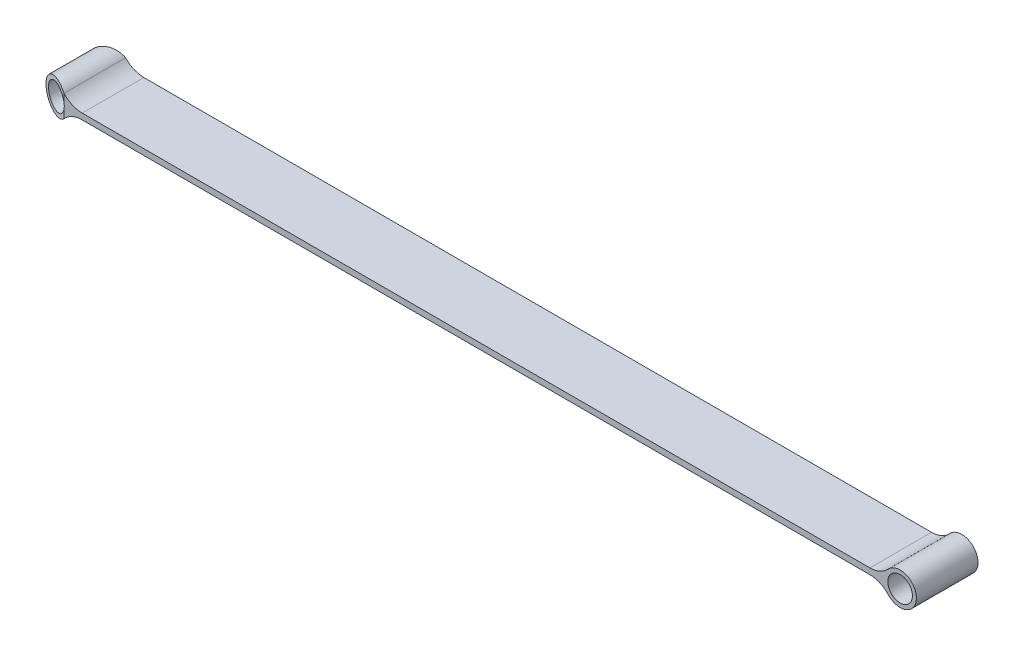
ISO-10303-21;
HEADER;
FILE_DESCRIPTION(('STEP AP214'),'2;1');
FILE_NAME('part.step','',(''),(''),'','','');
FILE_SCHEMA(('AUTOMOTIVE_DESIGN { 1 0 10303 214 1 1 1 1 }'));
ENDSEC;
DATA;
#1=APPLICATION_CONTEXT('core data for automotive mechanical design processes');
#2=APPLICATION_PROTOCOL_DEFINITION('international standard','automotive_design',2000,#1);
#3=PRODUCT_CONTEXT('',#1,'mechanical');
#4=PRODUCT('Part','Part','',(#3));
#5=PRODUCT_RELATED_PRODUCT_CATEGORY('part','',(#4));
#6=PRODUCT_DEFINITION_FORMATION('','',#4);
#7=PRODUCT_DEFINITION_CONTEXT('part definition',#1,'design');
#8=PRODUCT_DEFINITION('design','',#6,#7);
#9=PRODUCT_DEFINITION_SHAPE('','',#8);
#10=(LENGTH_UNIT() NAMED_UNIT(*) SI_UNIT(.MILLI.,.METRE.));
#11=(NAMED_UNIT(*) PLANE_ANGLE_UNIT() SI_UNIT($,.RADIAN.));
#12=(NAMED_UNIT(*) SI_UNIT($,.STERADIAN.) SOLID_ANGLE_UNIT());
#13=UNCERTAINTY_MEASURE_WITH_UNIT(LENGTH_MEASURE(1.E-05),#10,'distance_accuracy_value','');
#14=(GEOMETRIC_REPRESENTATION_CONTEXT(3) GLOBAL_UNCERTAINTY_ASSIGNED_CONTEXT((#13)) GLOBAL_UNIT_ASSIGNED_CONTEXT((#10,
#11,#12)) REPRESENTATION_CONTEXT('',''));
#15=CARTESIAN_POINT('',(0.,0.,0.));
#16=DIRECTION('',(0.,0.,1.));
#17=DIRECTION('',(1.,0.,0.));
#18=AXIS2_PLACEMENT_3D('',#15,#16,#17);
#19=CARTESIAN_POINT('',(-101.6,1.524,-7.9375));
#20=DIRECTION('',(0.,0.,1.));
#21=DIRECTION('',(1.,0.,0.));
#22=AXIS2_PLACEMENT_3D('',#19,#20,#21);
#23=PLANE('',#22);
#24=CARTESIAN_POINT('',(109.22,0.762,-7.9375));
#25=DIRECTION('',(0.,0.,-1.));
#26=DIRECTION('',(-1.,0.,0.));
#27=AXIS2_PLACEMENT_3D('',#24,#25,#26);
#28=CIRCLE('',#27,3.175);
#29=CARTESIAN_POINT('',(106.045,0.762,-7.9375));
#30=VERTEX_POINT('',#29);
#31=EDGE_CURVE('E182',#30,#30,#28,.T.);
#32=ORIENTED_EDGE('',*,*,#31,.F.);
#33=EDGE_LOOP('',(#32));
#34=FACE_BOUND('',#33,.T.);
#35=DIRECTION('',(0.,-1.,0.));
#36=VECTOR('',#35,1.);
#37=CARTESIAN_POINT('',(-106.126651501303,4.953,-7.9375));
#38=LINE('',#37,#36);
#39=CARTESIAN_POINT('',(-106.126651501303,3.58966265060242,-7.9375));
#40=VERTEX_POINT('',#39);
#41=CARTESIAN_POINT('',(-106.126651501303,1.47741600877522,-7.9375));
#42=VERTEX_POINT('',#41);
#43=EDGE_CURVE('E60',#40,#42,#38,.T.);
#44=ORIENTED_EDGE('',*,*,#43,.F.);
#45=CARTESIAN_POINT('',(-101.439759836612,7.874,-7.9375));
#46=DIRECTION('',(0.,0.,1.));
#47=DIRECTION('',(1.,0.,0.));
#48=AXIS2_PLACEMENT_3D('',#45,#46,#47);
#49=CIRCLE('',#48,6.35);
#50=CARTESIAN_POINT('',(-101.439759836612,1.524,-7.9375));
#51=VERTEX_POINT('',#50);
#52=EDGE_CURVE('E140',#51,#40,#49,.F.);
#53=ORIENTED_EDGE('',*,*,#52,.F.);
#54=DIRECTION('',(-1.,0.,0.));
#55=VECTOR('',#54,1.);
#56=CARTESIAN_POINT('',(-101.6,1.524,-7.9375));
#57=LINE('',#56,#55);
#58=CARTESIAN_POINT('',(101.439759836612,1.524,-7.9375));
#59=VERTEX_POINT('',#58);
#60=EDGE_CURVE('E44',#59,#51,#57,.T.);
#61=ORIENTED_EDGE('',*,*,#60,.F.);
#62=CARTESIAN_POINT('',(101.439759836612,7.874,-7.9375));
#63=DIRECTION('',(0.,0.,-1.));
#64=DIRECTION('',(-1.,0.,0.));
#65=AXIS2_PLACEMENT_3D('',#62,#63,#64);
#66=CIRCLE('',#65,6.35);
#67=CARTESIAN_POINT('',(106.126651501303,3.58966265060241,-7.9375));
#68=VERTEX_POINT('',#67);
#69=EDGE_CURVE('E214',#59,#68,#66,.F.);
#70=ORIENTED_EDGE('',*,*,#69,.T.);
#71=CARTESIAN_POINT('',(109.22,0.762,-7.9375));
#72=DIRECTION('',(0.,0.,-1.));
#73=DIRECTION('',(-1.,0.,0.));
#74=AXIS2_PLACEMENT_3D('',#71,#72,#73);
#75=CIRCLE('',#74,4.191);
#76=CARTESIAN_POINT('',(106.126651501303,-2.06566265060241,-7.9375));
#77=VERTEX_POINT('',#76);
#78=EDGE_CURVE('E186',#68,#77,#75,.T.);
#79=ORIENTED_EDGE('',*,*,#78,.T.);
#80=CARTESIAN_POINT('',(101.439759836612,-6.35,-7.9375));
#81=DIRECTION('',(0.,0.,-1.));
#82=DIRECTION('',(-1.,0.,0.));
#83=AXIS2_PLACEMENT_3D('',#80,#81,#82);
#84=CIRCLE('',#83,6.35);
#85=CARTESIAN_POINT('',(101.439759836612,0.,-7.9375));
#86=VERTEX_POINT('',#85);
#87=EDGE_CURVE('E199',#77,#86,#84,.F.);
#88=ORIENTED_EDGE('',*,*,#87,.T.);
#89=DIRECTION('',(-1.,0.,0.));
#90=VECTOR('',#89,1.);
#91=CARTESIAN_POINT('',(-101.6,0.,-7.9375));
#92=LINE('',#91,#90);
#93=CARTESIAN_POINT('',(-101.439759836612,0.,-7.9375));
#94=VERTEX_POINT('',#93);
#95=EDGE_CURVE('E141',#86,#94,#92,.T.);
#96=ORIENTED_EDGE('',*,*,#95,.T.);
#97=CARTESIAN_POINT('',(-101.439759836612,-6.35,-7.9375));
#98=DIRECTION('',(0.,0.,1.));
#99=DIRECTION('',(1.,0.,0.));
#100=AXIS2_PLACEMENT_3D('',#97,#98,#99);
#101=CIRCLE('',#100,6.35);
#102=CARTESIAN_POINT('',(-106.126651501303,-2.06566265060241,-7.9375));
#103=VERTEX_POINT('',#102);
#104=EDGE_CURVE('E152',#103,#94,#101,.F.);
#105=ORIENTED_EDGE('',*,*,#104,.F.);
#106=CARTESIAN_POINT('',(-106.126651501303,0.0465839912247837,-7.9375));
#107=VERTEX_POINT('',#106);
#108=EDGE_CURVE('E120',#107,#103,#38,.T.);
#109=ORIENTED_EDGE('',*,*,#108,.F.);
#110=CARTESIAN_POINT('',(-109.22,0.762,-7.9375));
#111=DIRECTION('',(0.,0.,1.));
#112=DIRECTION('',(1.,0.,0.));
#113=AXIS2_PLACEMENT_3D('',#110,#111,#112);
#114=CIRCLE('',#113,3.175);
#115=EDGE_CURVE('E148',#107,#42,#114,.T.);
#116=ORIENTED_EDGE('',*,*,#115,.T.);
#117=EDGE_LOOP('',(#44,#53,#61,#70,#79,#88,#96,#105,#109,#116));
#118=FACE_BOUND('',#117,.T.);
#119=ADVANCED_FACE('F36',(#34,#118),#23,.F.);
#120=CARTESIAN_POINT('',(-109.22,0.762,-7.9375));
#121=DIRECTION('',(0.,0.,1.));
#122=DIRECTION('',(1.,0.,0.));
#123=AXIS2_PLACEMENT_3D('',#120,#121,#122);
#124=CYLINDRICAL_SURFACE('',#123,4.191);
#125=DIRECTION('',(0.,0.,1.));
#126=VECTOR('',#125,1.);
#127=CARTESIAN_POINT('',(-106.126651501303,3.58966265060241,-7.9375));
#128=LINE('',#127,#126);
#129=CARTESIAN_POINT('',(-106.126651501303,3.58966265060242,7.9375));
#130=VERTEX_POINT('',#129);
#131=EDGE_CURVE('E127',#40,#130,#128,.T.);
#132=ORIENTED_EDGE('',*,*,#131,.F.);
#133=CARTESIAN_POINT('',(-109.22,0.762,-6.81161322226244));
#134=DIRECTION('',(-0.342020143325663,0.,-0.93969262078591));
#135=DIRECTION('',(-0.93969262078591,0.,0.342020143325663));
#136=AXIS2_PLACEMENT_3D('',#133,#134,#135);
#137=ELLIPSE('',#136,4.45996904444653,4.191);
#138=EDGE_CURVE('E209',#40,#103,#137,.F.);
#139=ORIENTED_EDGE('',*,*,#138,.T.);
#140=DIRECTION('',(0.,0.,1.));
#141=VECTOR('',#140,1.);
#142=CARTESIAN_POINT('',(-106.126651501303,-2.06566265060241,-7.9375));
#143=LINE('',#142,#141);
#144=CARTESIAN_POINT('',(-106.126651501303,-2.06566265060241,7.9375));
#145=VERTEX_POINT('',#144);
#146=EDGE_CURVE('E130',#103,#145,#143,.T.);
#147=ORIENTED_EDGE('',*,*,#146,.T.);
#148=CARTESIAN_POINT('',(-109.22,0.762,6.81161322226244));
#149=DIRECTION('',(0.342020143325663,0.,-0.93969262078591));
#150=DIRECTION('',(0.93969262078591,0.,0.342020143325663));
#151=AXIS2_PLACEMENT_3D('',#148,#149,#150);
#152=ELLIPSE('',#151,4.45996904444653,4.191);
#153=EDGE_CURVE('E114',#130,#145,#152,.F.);
#154=ORIENTED_EDGE('',*,*,#153,.F.);
#155=EDGE_LOOP('',(#132,#139,#147,#154));
#156=FACE_BOUND('',#155,.T.);
#157=ADVANCED_FACE('F126',(#156),#124,.T.);
#158=CARTESIAN_POINT('',(-109.22,0.762,-7.9375));
#159=DIRECTION('',(0.,0.,1.));
#160=DIRECTION('',(1.,0.,0.));
#161=AXIS2_PLACEMENT_3D('',#158,#159,#160);
#162=CYLINDRICAL_SURFACE('',#161,3.175);
#163=CARTESIAN_POINT('',(-109.22,0.762,7.9375));
#164=DIRECTION('',(0.,0.,1.));
#165=DIRECTION('',(1.,0.,0.));
#166=AXIS2_PLACEMENT_3D('',#163,#164,#165);
#167=CIRCLE('',#166,3.175);
#168=CARTESIAN_POINT('',(-106.126651501303,0.0465839912247604,7.9375));
#169=VERTEX_POINT('',#168);
#170=CARTESIAN_POINT('',(-106.126651501303,1.47741600877522,7.9375));
#171=VERTEX_POINT('',#170);
#172=EDGE_CURVE('E154',#169,#171,#167,.T.);
#173=ORIENTED_EDGE('',*,*,#172,.T.);
#174=CARTESIAN_POINT('',(-109.22,0.762,6.81161322226244));
#175=DIRECTION('',(0.342020143325663,0.,-0.93969262078591));
#176=DIRECTION('',(0.93969262078591,0.,0.342020143325663));
#177=AXIS2_PLACEMENT_3D('',#174,#175,#176);
#178=ELLIPSE('',#177,3.37876442761101,3.175);
#179=EDGE_CURVE('E115',#171,#169,#178,.F.);
#180=ORIENTED_EDGE('',*,*,#179,.T.);
#181=EDGE_LOOP('',(#173,#180));
#182=FACE_BOUND('',#181,.T.);
#183=CARTESIAN_POINT('',(-109.22,0.762,-6.81161322226244));
#184=DIRECTION('',(-0.342020143325663,0.,-0.93969262078591));
#185=DIRECTION('',(-0.93969262078591,0.,0.342020143325663));
#186=AXIS2_PLACEMENT_3D('',#183,#184,#185);
#187=ELLIPSE('',#186,3.37876442761101,3.175);
#188=EDGE_CURVE('E132',#42,#107,#187,.F.);
#189=ORIENTED_EDGE('',*,*,#188,.F.);
#190=ORIENTED_EDGE('',*,*,#115,.F.);
#191=EDGE_LOOP('',(#189,#190));
#192=FACE_BOUND('',#191,.T.);
#193=ADVANCED_FACE('F203',(#182,#192),#162,.F.);
#194=CARTESIAN_POINT('',(0.,1.524,0.));
#195=DIRECTION('',(0.,-1.,0.));
#196=DIRECTION('',(0.,0.,-1.));
#197=AXIS2_PLACEMENT_3D('',#194,#195,#196);
#198=PLANE('',#197);
#199=DIRECTION('',(0.,0.,1.));
#200=VECTOR('',#199,1.);
#201=CARTESIAN_POINT('',(101.439759836612,1.524,-7.9375));
#202=LINE('',#201,#200);
#203=CARTESIAN_POINT('',(101.439759836612,1.524,7.9375));
#204=VERTEX_POINT('',#203);
#205=EDGE_CURVE('E194',#59,#204,#202,.T.);
#206=ORIENTED_EDGE('',*,*,#205,.F.);
#207=ORIENTED_EDGE('',*,*,#60,.T.);
#208=DIRECTION('',(0.,0.,1.));
#209=VECTOR('',#208,1.);
#210=CARTESIAN_POINT('',(-101.439759836612,1.524,-7.9375));
#211=LINE('',#210,#209);
#212=CARTESIAN_POINT('',(-101.439759836612,1.524,7.9375));
#213=VERTEX_POINT('',#212);
#214=EDGE_CURVE('E142',#51,#213,#211,.T.);
#215=ORIENTED_EDGE('',*,*,#214,.T.);
#216=DIRECTION('',(1.,0.,0.));
#217=VECTOR('',#216,1.);
#218=CARTESIAN_POINT('',(-101.6,1.524,7.9375));
#219=LINE('',#218,#217);
#220=EDGE_CURVE('E11',#213,#204,#219,.T.);
#221=ORIENTED_EDGE('',*,*,#220,.T.);
#222=EDGE_LOOP('',(#206,#207,#215,#221));
#223=FACE_BOUND('',#222,.T.);
#224=ADVANCED_FACE('F227',(#223),#198,.F.);
#225=CARTESIAN_POINT('',(0.,0.,0.));
#226=DIRECTION('',(0.,-1.,0.));
#227=DIRECTION('',(0.,0.,-1.));
#228=AXIS2_PLACEMENT_3D('',#225,#226,#227);
#229=PLANE('',#228);
#230=ORIENTED_EDGE('',*,*,#95,.F.);
#231=DIRECTION('',(0.,0.,1.));
#232=VECTOR('',#231,1.);
#233=CARTESIAN_POINT('',(101.439759836612,0.,-7.9375));
#234=LINE('',#233,#232);
#235=CARTESIAN_POINT('',(101.439759836612,0.,7.9375));
#236=VERTEX_POINT('',#235);
#237=EDGE_CURVE('E178',#86,#236,#234,.T.);
#238=ORIENTED_EDGE('',*,*,#237,.T.);
#239=DIRECTION('',(1.,0.,0.));
#240=VECTOR('',#239,1.);
#241=CARTESIAN_POINT('',(-101.6,0.,7.9375));
#242=LINE('',#241,#240);
#243=CARTESIAN_POINT('',(-101.439759836612,0.,7.9375));
#244=VERTEX_POINT('',#243);
#245=EDGE_CURVE('E39',#244,#236,#242,.T.);
#246=ORIENTED_EDGE('',*,*,#245,.F.);
#247=DIRECTION('',(0.,0.,1.));
#248=VECTOR('',#247,1.);
#249=CARTESIAN_POINT('',(-101.439759836612,0.,-7.9375));
#250=LINE('',#249,#248);
#251=EDGE_CURVE('E159',#94,#244,#250,.T.);
#252=ORIENTED_EDGE('',*,*,#251,.F.);
#253=EDGE_LOOP('',(#230,#238,#246,#252));
#254=FACE_BOUND('',#253,.T.);
#255=ADVANCED_FACE('F234',(#254),#229,.T.);
#256=CARTESIAN_POINT('',(-101.6,1.524,7.9375));
#257=DIRECTION('',(0.,0.,-1.));
#258=DIRECTION('',(-1.,0.,0.));
#259=AXIS2_PLACEMENT_3D('',#256,#257,#258);
#260=PLANE('',#259);
#261=CARTESIAN_POINT('',(-101.439759836612,7.874,7.9375));
#262=DIRECTION('',(0.,0.,1.));
#263=DIRECTION('',(1.,0.,0.));
#264=AXIS2_PLACEMENT_3D('',#261,#262,#263);
#265=CIRCLE('',#264,6.35);
#266=EDGE_CURVE('E137',#213,#130,#265,.F.);
#267=ORIENTED_EDGE('',*,*,#266,.T.);
#268=DIRECTION('',(0.,-1.,0.));
#269=VECTOR('',#268,1.);
#270=CARTESIAN_POINT('',(-106.126651501303,4.953,7.9375));
#271=LINE('',#270,#269);
#272=EDGE_CURVE('E111',#130,#171,#271,.T.);
#273=ORIENTED_EDGE('',*,*,#272,.T.);
#274=ORIENTED_EDGE('',*,*,#172,.F.);
#275=EDGE_CURVE('E52',#169,#145,#271,.T.);
#276=ORIENTED_EDGE('',*,*,#275,.T.);
#277=CARTESIAN_POINT('',(-101.439759836612,-6.35,7.9375));
#278=DIRECTION('',(0.,0.,1.));
#279=DIRECTION('',(1.,0.,0.));
#280=AXIS2_PLACEMENT_3D('',#277,#278,#279);
#281=CIRCLE('',#280,6.35);
#282=EDGE_CURVE('E149',#145,#244,#281,.F.);
#283=ORIENTED_EDGE('',*,*,#282,.T.);
#284=ORIENTED_EDGE('',*,*,#245,.T.);
#285=CARTESIAN_POINT('',(101.439759836612,-6.35,7.9375));
#286=DIRECTION('',(0.,0.,-1.));
#287=DIRECTION('',(-1.,0.,0.));
#288=AXIS2_PLACEMENT_3D('',#285,#286,#287);
#289=CIRCLE('',#288,6.35);
#290=CARTESIAN_POINT('',(106.126651501303,-2.06566265060241,7.9375));
#291=VERTEX_POINT('',#290);
#292=EDGE_CURVE('E171',#291,#236,#289,.F.);
#293=ORIENTED_EDGE('',*,*,#292,.F.);
#294=CARTESIAN_POINT('',(109.22,0.762,7.9375));
#295=DIRECTION('',(0.,0.,-1.));
#296=DIRECTION('',(-1.,0.,0.));
#297=AXIS2_PLACEMENT_3D('',#294,#295,#296);
#298=CIRCLE('',#297,4.191);
#299=CARTESIAN_POINT('',(106.126651501303,3.58966265060241,7.9375));
#300=VERTEX_POINT('',#299);
#301=EDGE_CURVE('E188',#300,#291,#298,.T.);
#302=ORIENTED_EDGE('',*,*,#301,.F.);
#303=CARTESIAN_POINT('',(101.439759836612,7.874,7.9375));
#304=DIRECTION('',(0.,0.,-1.));
#305=DIRECTION('',(-1.,0.,0.));
#306=AXIS2_PLACEMENT_3D('',#303,#304,#305);
#307=CIRCLE('',#306,6.35);
#308=EDGE_CURVE('E183',#204,#300,#307,.F.);
#309=ORIENTED_EDGE('',*,*,#308,.F.);
#310=ORIENTED_EDGE('',*,*,#220,.F.);
#311=EDGE_LOOP('',(#267,#273,#274,#276,#283,#284,#293,#302,#309,#310));
#312=FACE_BOUND('',#311,.T.);
#313=CARTESIAN_POINT('',(109.22,0.762,7.9375));
#314=DIRECTION('',(0.,0.,-1.));
#315=DIRECTION('',(-1.,0.,0.));
#316=AXIS2_PLACEMENT_3D('',#313,#314,#315);
#317=CIRCLE('',#316,3.175);
#318=CARTESIAN_POINT('',(106.045,0.762,7.9375));
#319=VERTEX_POINT('',#318);
#320=EDGE_CURVE('E210',#319,#319,#317,.T.);
#321=ORIENTED_EDGE('',*,*,#320,.T.);
#322=EDGE_LOOP('',(#321));
#323=FACE_BOUND('',#322,.T.);
#324=ADVANCED_FACE('F145',(#312,#323),#260,.F.);
#325=CARTESIAN_POINT('',(-101.439759836612,7.874,-7.9375));
#326=DIRECTION('',(0.,0.,1.));
#327=DIRECTION('',(1.,0.,0.));
#328=AXIS2_PLACEMENT_3D('',#325,#326,#327);
#329=CYLINDRICAL_SURFACE('',#328,6.35);
#330=ORIENTED_EDGE('',*,*,#266,.F.);
#331=ORIENTED_EDGE('',*,*,#214,.F.);
#332=ORIENTED_EDGE('',*,*,#52,.T.);
#333=ORIENTED_EDGE('',*,*,#131,.T.);
#334=EDGE_LOOP('',(#330,#331,#332,#333));
#335=FACE_BOUND('',#334,.T.);
#336=ADVANCED_FACE('F135',(#335),#329,.F.);
#337=CARTESIAN_POINT('',(-101.439759836612,-6.35,-7.9375));
#338=DIRECTION('',(0.,0.,1.));
#339=DIRECTION('',(1.,0.,0.));
#340=AXIS2_PLACEMENT_3D('',#337,#338,#339);
#341=CYLINDRICAL_SURFACE('',#340,6.35);
#342=ORIENTED_EDGE('',*,*,#282,.F.);
#343=ORIENTED_EDGE('',*,*,#146,.F.);
#344=ORIENTED_EDGE('',*,*,#104,.T.);
#345=ORIENTED_EDGE('',*,*,#251,.T.);
#346=EDGE_LOOP('',(#342,#343,#344,#345));
#347=FACE_BOUND('',#346,.T.);
#348=ADVANCED_FACE('F233',(#347),#341,.F.);
#349=CARTESIAN_POINT('',(109.22,0.762,-7.9375));
#350=DIRECTION('',(0.,0.,1.));
#351=DIRECTION('',(1.,0.,0.));
#352=AXIS2_PLACEMENT_3D('',#349,#350,#351);
#353=CYLINDRICAL_SURFACE('',#352,4.191);
#354=ORIENTED_EDGE('',*,*,#301,.T.);
#355=DIRECTION('',(0.,0.,1.));
#356=VECTOR('',#355,1.);
#357=CARTESIAN_POINT('',(106.126651501303,-2.06566265060241,-7.9375));
#358=LINE('',#357,#356);
#359=EDGE_CURVE('E180',#77,#291,#358,.T.);
#360=ORIENTED_EDGE('',*,*,#359,.F.);
#361=ORIENTED_EDGE('',*,*,#78,.F.);
#362=DIRECTION('',(0.,0.,1.));
#363=VECTOR('',#362,1.);
#364=CARTESIAN_POINT('',(106.126651501303,3.58966265060241,-7.9375));
#365=LINE('',#364,#363);
#366=EDGE_CURVE('E197',#68,#300,#365,.T.);
#367=ORIENTED_EDGE('',*,*,#366,.T.);
#368=EDGE_LOOP('',(#354,#360,#361,#367));
#369=FACE_BOUND('',#368,.T.);
#370=ADVANCED_FACE('F219',(#369),#353,.T.);
#371=CARTESIAN_POINT('',(101.439759836612,-6.35,-7.9375));
#372=DIRECTION('',(0.,0.,1.));
#373=DIRECTION('',(1.,0.,0.));
#374=AXIS2_PLACEMENT_3D('',#371,#372,#373);
#375=CYLINDRICAL_SURFACE('',#374,6.35);
#376=ORIENTED_EDGE('',*,*,#292,.T.);
#377=ORIENTED_EDGE('',*,*,#237,.F.);
#378=ORIENTED_EDGE('',*,*,#87,.F.);
#379=ORIENTED_EDGE('',*,*,#359,.T.);
#380=EDGE_LOOP('',(#376,#377,#378,#379));
#381=FACE_BOUND('',#380,.T.);
#382=ADVANCED_FACE('F177',(#381),#375,.F.);
#383=CARTESIAN_POINT('',(109.22,0.762,-7.9375));
#384=DIRECTION('',(0.,0.,1.));
#385=DIRECTION('',(1.,0.,0.));
#386=AXIS2_PLACEMENT_3D('',#383,#384,#385);
#387=CYLINDRICAL_SURFACE('',#386,3.175);
#388=ORIENTED_EDGE('',*,*,#31,.T.);
#389=EDGE_LOOP('',(#388));
#390=FACE_BOUND('',#389,.T.);
#391=ORIENTED_EDGE('',*,*,#320,.F.);
#392=EDGE_LOOP('',(#391));
#393=FACE_BOUND('',#392,.T.);
#394=ADVANCED_FACE('F250',(#390,#393),#387,.F.);
#395=CARTESIAN_POINT('',(101.439759836612,7.874,-7.9375));
#396=DIRECTION('',(0.,0.,1.));
#397=DIRECTION('',(1.,0.,0.));
#398=AXIS2_PLACEMENT_3D('',#395,#396,#397);
#399=CYLINDRICAL_SURFACE('',#398,6.35);
#400=ORIENTED_EDGE('',*,*,#308,.T.);
#401=ORIENTED_EDGE('',*,*,#366,.F.);
#402=ORIENTED_EDGE('',*,*,#69,.F.);
#403=ORIENTED_EDGE('',*,*,#205,.T.);
#404=EDGE_LOOP('',(#400,#401,#402,#403));
#405=FACE_BOUND('',#404,.T.);
#406=ADVANCED_FACE('F223',(#405),#399,.F.);
#407=CARTESIAN_POINT('',(-14.9655232518958,4.953,41.1174372049076));
#408=DIRECTION('',(0.342020143325663,0.,-0.93969262078591));
#409=DIRECTION('',(-0.93969262078591,0.,-0.342020143325663));
#410=AXIS2_PLACEMENT_3D('',#407,#408,#409);
#411=PLANE('',#410);
#412=ORIENTED_EDGE('',*,*,#153,.T.);
#413=ORIENTED_EDGE('',*,*,#275,.F.);
#414=ORIENTED_EDGE('',*,*,#179,.F.);
#415=ORIENTED_EDGE('',*,*,#272,.F.);
#416=EDGE_LOOP('',(#412,#413,#414,#415));
#417=FACE_BOUND('',#416,.T.);
#418=ADVANCED_FACE('F113',(#417),#411,.F.);
#419=CARTESIAN_POINT('',(-14.9655232518958,4.953,-41.1174372049076));
#420=DIRECTION('',(-0.342020143325663,0.,-0.93969262078591));
#421=DIRECTION('',(-0.93969262078591,0.,0.342020143325663));
#422=AXIS2_PLACEMENT_3D('',#419,#420,#421);
#423=PLANE('',#422);
#424=ORIENTED_EDGE('',*,*,#138,.F.);
#425=ORIENTED_EDGE('',*,*,#43,.T.);
#426=ORIENTED_EDGE('',*,*,#188,.T.);
#427=ORIENTED_EDGE('',*,*,#108,.T.);
#428=EDGE_LOOP('',(#424,#425,#426,#427));
#429=FACE_BOUND('',#428,.T.);
#430=ADVANCED_FACE('F231',(#429),#423,.T.);
#431=CLOSED_SHELL('',(#119,#157,#193,#224,#255,#324,#336,#348,#370,#382,#394,#406,#418,#430));
#432=MANIFOLD_SOLID_BREP('B2',#431);
#433=ADVANCED_BREP_SHAPE_REPRESENTATION('',(#18,#432),#14);
#434=SHAPE_DEFINITION_REPRESENTATION(#9,#433);
ENDSEC;
END-ISO-10303-21;
